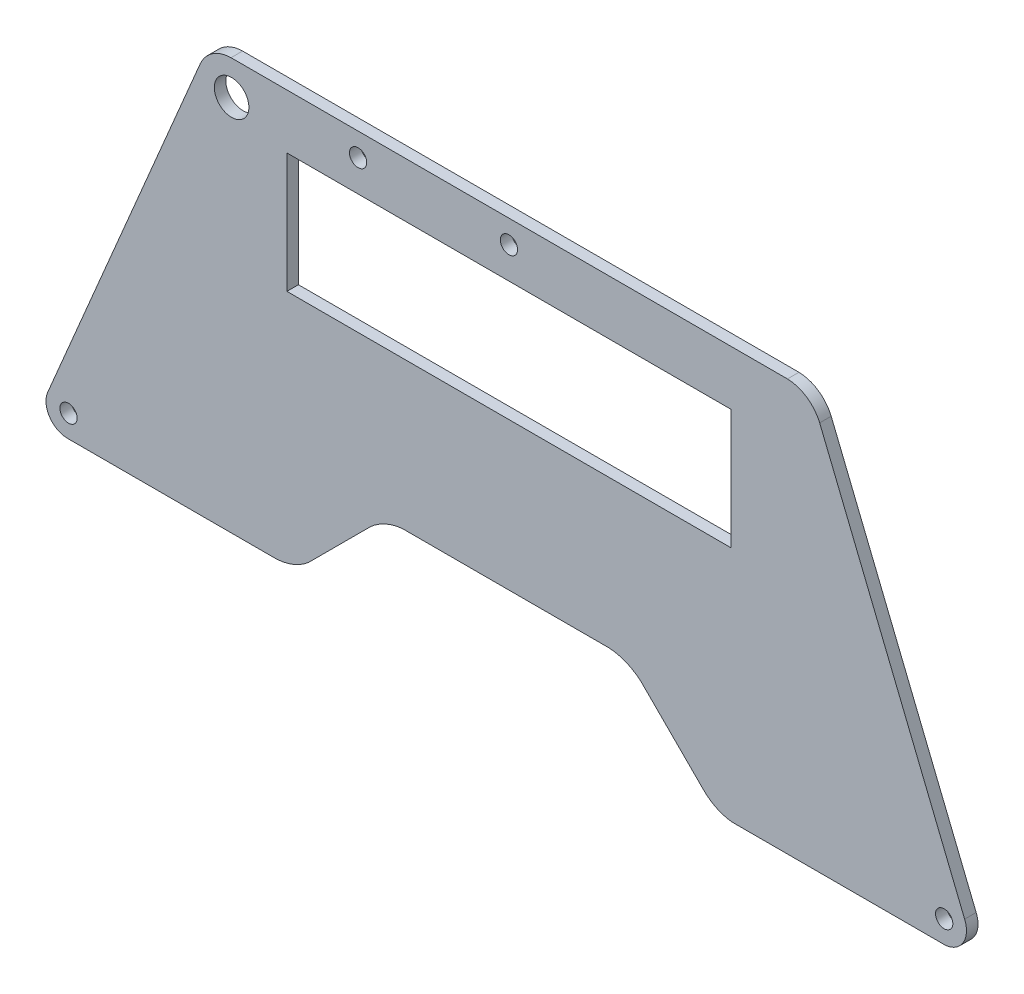
ISO-10303-21;
HEADER;
FILE_DESCRIPTION(('STEP AP214'),'2;1');
FILE_NAME('part.step','',(''),(''),'','','');
FILE_SCHEMA(('AUTOMOTIVE_DESIGN { 1 0 10303 214 1 1 1 1 }'));
ENDSEC;
DATA;
#1=APPLICATION_CONTEXT('core data for automotive mechanical design processes');
#2=APPLICATION_PROTOCOL_DEFINITION('international standard','automotive_design',2000,#1);
#3=PRODUCT_CONTEXT('',#1,'mechanical');
#4=PRODUCT('Part','Part','',(#3));
#5=PRODUCT_RELATED_PRODUCT_CATEGORY('part','',(#4));
#6=PRODUCT_DEFINITION_FORMATION('','',#4);
#7=PRODUCT_DEFINITION_CONTEXT('part definition',#1,'design');
#8=PRODUCT_DEFINITION('design','',#6,#7);
#9=PRODUCT_DEFINITION_SHAPE('','',#8);
#10=(LENGTH_UNIT() NAMED_UNIT(*) SI_UNIT(.MILLI.,.METRE.));
#11=(NAMED_UNIT(*) PLANE_ANGLE_UNIT() SI_UNIT($,.RADIAN.));
#12=(NAMED_UNIT(*) SI_UNIT($,.STERADIAN.) SOLID_ANGLE_UNIT());
#13=UNCERTAINTY_MEASURE_WITH_UNIT(LENGTH_MEASURE(1.E-05),#10,'distance_accuracy_value','');
#14=(GEOMETRIC_REPRESENTATION_CONTEXT(3) GLOBAL_UNCERTAINTY_ASSIGNED_CONTEXT((#13)) GLOBAL_UNIT_ASSIGNED_CONTEXT((#10,
#11,#12)) REPRESENTATION_CONTEXT('',''));
#15=CARTESIAN_POINT('',(0.,0.,0.));
#16=DIRECTION('',(0.,0.,1.));
#17=DIRECTION('',(1.,0.,0.));
#18=AXIS2_PLACEMENT_3D('',#15,#16,#17);
#19=CARTESIAN_POINT('',(-4.151217638522,4.131310422763,2.));
#20=DIRECTION('',(0.,0.,1.));
#21=DIRECTION('',(1.,0.,0.));
#22=AXIS2_PLACEMENT_3D('',#19,#20,#21);
#23=PLANE('',#22);
#24=DIRECTION('',(0.,-1.,0.));
#25=VECTOR('',#24,1.);
#26=CARTESIAN_POINT('',(-41.0120005829996,41.2408212324495,2.));
#27=LINE('',#26,#25);
#28=CARTESIAN_POINT('',(-41.0120005829996,62.0408178666725,2.));
#29=VERTEX_POINT('',#28);
#30=CARTESIAN_POINT('',(-41.0120005829996,41.2408212324495,2.));
#31=VERTEX_POINT('',#30);
#32=EDGE_CURVE('E176',#29,#31,#27,.T.);
#33=ORIENTED_EDGE('',*,*,#32,.T.);
#34=DIRECTION('',(-1.,0.,0.));
#35=VECTOR('',#34,1.);
#36=CARTESIAN_POINT('',(-41.0120005829996,41.2408212324495,2.));
#37=LINE('',#36,#35);
#38=CARTESIAN_POINT('',(-118.012001492196,41.2408212324495,2.));
#39=VERTEX_POINT('',#38);
#40=EDGE_CURVE('E185',#31,#39,#37,.T.);
#41=ORIENTED_EDGE('',*,*,#40,.T.);
#42=DIRECTION('',(0.,1.,0.));
#43=VECTOR('',#42,1.);
#44=CARTESIAN_POINT('',(-118.012001492196,41.2408212324495,2.));
#45=LINE('',#44,#43);
#46=CARTESIAN_POINT('',(-118.012001492196,62.0408178666725,2.));
#47=VERTEX_POINT('',#46);
#48=EDGE_CURVE('E52',#39,#47,#45,.T.);
#49=ORIENTED_EDGE('',*,*,#48,.T.);
#50=DIRECTION('',(1.,0.,0.));
#51=VECTOR('',#50,1.);
#52=CARTESIAN_POINT('',(-41.0120005829996,62.0408178666725,2.));
#53=LINE('',#52,#51);
#54=EDGE_CURVE('E182',#47,#29,#53,.T.);
#55=ORIENTED_EDGE('',*,*,#54,.T.);
#56=EDGE_LOOP('',(#33,#41,#49,#55));
#57=FACE_BOUND('',#56,.T.);
#58=CARTESIAN_POINT('',(-4.,4.,2.));
#59=DIRECTION('',(0.,0.,1.));
#60=DIRECTION('',(1.,0.,0.));
#61=AXIS2_PLACEMENT_3D('',#58,#59,#60);
#62=CIRCLE('',#61,1.5);
#63=CARTESIAN_POINT('',(-2.5,4.,2.));
#64=VERTEX_POINT('',#63);
#65=EDGE_CURVE('E216',#64,#64,#62,.T.);
#66=ORIENTED_EDGE('',*,*,#65,.F.);
#67=EDGE_LOOP('',(#66));
#68=FACE_BOUND('',#67,.T.);
#69=CARTESIAN_POINT('',(-105.664,67.501,2.));
#70=DIRECTION('',(0.,0.,1.));
#71=DIRECTION('',(1.,0.,0.));
#72=AXIS2_PLACEMENT_3D('',#69,#70,#71);
#73=CIRCLE('',#72,1.5);
#74=CARTESIAN_POINT('',(-104.164,67.501,2.));
#75=VERTEX_POINT('',#74);
#76=EDGE_CURVE('E228',#75,#75,#73,.T.);
#77=ORIENTED_EDGE('',*,*,#76,.F.);
#78=EDGE_LOOP('',(#77));
#79=FACE_BOUND('',#78,.T.);
#80=CARTESIAN_POINT('',(-4.151217638522,4.131310422763,2.));
#81=DIRECTION('',(0.,0.,1.));
#82=DIRECTION('',(1.,0.,0.));
#83=AXIS2_PLACEMENT_3D('',#80,#81,#82);
#84=CIRCLE('',#83,4.02396369444375);
#85=CARTESIAN_POINT('',(-3.754,0.127,2.));
#86=VERTEX_POINT('',#85);
#87=CARTESIAN_POINT('',(-0.451999999999999,5.715,2.));
#88=VERTEX_POINT('',#87);
#89=EDGE_CURVE('E240',#86,#88,#84,.T.);
#90=ORIENTED_EDGE('',*,*,#89,.T.);
#91=DIRECTION('',(-0.375969548658757,0.926632018916533,0.));
#92=VECTOR('',#91,1.);
#93=CARTESIAN_POINT('',(-0.451999999999999,5.715,2.));
#94=LINE('',#93,#92);
#95=CARTESIAN_POINT('',(-25.5979999999999,67.691,2.));
#96=VERTEX_POINT('',#95);
#97=EDGE_CURVE('E243',#88,#96,#94,.T.);
#98=ORIENTED_EDGE('',*,*,#97,.T.);
#99=CARTESIAN_POINT('',(-31.340445195421,65.271613713382,2.));
#100=DIRECTION('',(0.,0.,1.));
#101=DIRECTION('',(1.,0.,0.));
#102=AXIS2_PLACEMENT_3D('',#99,#100,#101);
#103=CIRCLE('',#102,6.23130057261644);
#104=CARTESIAN_POINT('',(-31.186,71.5009999999998,2.));
#105=VERTEX_POINT('',#104);
#106=EDGE_CURVE('E246',#96,#105,#103,.T.);
#107=ORIENTED_EDGE('',*,*,#106,.T.);
#108=DIRECTION('',(-1.,0.,0.));
#109=VECTOR('',#108,1.);
#110=CARTESIAN_POINT('',(-31.186,71.5009999999998,2.));
#111=LINE('',#110,#109);
#112=CARTESIAN_POINT('',(-127.706,71.5010000000001,2.));
#113=VERTEX_POINT('',#112);
#114=EDGE_CURVE('E248',#105,#113,#111,.T.);
#115=ORIENTED_EDGE('',*,*,#114,.T.);
#116=CARTESIAN_POINT('',(-127.61079487934,65.579692319011,2.));
#117=DIRECTION('',(0.,0.,1.));
#118=DIRECTION('',(1.,0.,0.));
#119=AXIS2_PLACEMENT_3D('',#116,#117,#118);
#120=CIRCLE('',#119,5.92207300427315);
#121=CARTESIAN_POINT('',(-133.04,67.9449999999999,2.));
#122=VERTEX_POINT('',#121);
#123=EDGE_CURVE('E250',#113,#122,#120,.T.);
#124=ORIENTED_EDGE('',*,*,#123,.T.);
#125=DIRECTION('',(-0.389395688742522,-0.921070571448647,0.));
#126=VECTOR('',#125,1.);
#127=CARTESIAN_POINT('',(-133.04,67.9449999999999,2.));
#128=LINE('',#127,#126);
#129=CARTESIAN_POINT('',(-159.456,5.46099999999984,2.));
#130=VERTEX_POINT('',#129);
#131=EDGE_CURVE('E252',#122,#130,#128,.T.);
#132=ORIENTED_EDGE('',*,*,#131,.T.);
#133=CARTESIAN_POINT('',(-156.06418230582,3.871649048777,2.));
#134=DIRECTION('',(0.,0.,1.));
#135=DIRECTION('',(1.,0.,0.));
#136=AXIS2_PLACEMENT_3D('',#133,#134,#135);
#137=CIRCLE('',#136,3.74572606001867);
#138=CARTESIAN_POINT('',(-156.154,0.126999999999228,2.));
#139=VERTEX_POINT('',#138);
#140=EDGE_CURVE('E254',#130,#139,#137,.T.);
#141=ORIENTED_EDGE('',*,*,#140,.T.);
#142=DIRECTION('',(1.,0.,0.));
#143=VECTOR('',#142,1.);
#144=CARTESIAN_POINT('',(-156.154,0.126999999999228,2.));
#145=LINE('',#144,#143);
#146=CARTESIAN_POINT('',(-119.832,0.127000000001192,2.));
#147=VERTEX_POINT('',#146);
#148=EDGE_CURVE('E256',#139,#147,#145,.T.);
#149=ORIENTED_EDGE('',*,*,#148,.T.);
#150=CARTESIAN_POINT('',(-120.33100582692,9.319569799157,2.));
#151=DIRECTION('',(0.,0.,1.));
#152=DIRECTION('',(1.,0.,0.));
#153=AXIS2_PLACEMENT_3D('',#150,#151,#152);
#154=CIRCLE('',#153,9.20610375390434);
#155=CARTESIAN_POINT('',(-114.243999999998,2.41299999999821,2.));
#156=VERTEX_POINT('',#155);
#157=EDGE_CURVE('E258',#147,#156,#154,.T.);
#158=ORIENTED_EDGE('',*,*,#157,.T.);
#159=DIRECTION('',(0.707106781186436,0.707106781186659,0.));
#160=VECTOR('',#159,1.);
#161=CARTESIAN_POINT('',(-114.243999999998,2.41299999999821,2.));
#162=LINE('',#161,#160);
#163=CARTESIAN_POINT('',(-103.576,13.0810000000001,2.));
#164=VERTEX_POINT('',#163);
#165=EDGE_CURVE('E260',#156,#164,#162,.T.);
#166=ORIENTED_EDGE('',*,*,#165,.T.);
#167=CARTESIAN_POINT('',(-97.057030091087,6.15606620039,2.));
#168=DIRECTION('',(0.,0.,-1.));
#169=DIRECTION('',(1.,0.,0.));
#170=AXIS2_PLACEMENT_3D('',#167,#168,#169);
#171=CIRCLE('',#170,9.51060864520752);
#172=CARTESIAN_POINT('',(-97.988,15.6209999999998,2.));
#173=VERTEX_POINT('',#172);
#174=EDGE_CURVE('E262',#164,#173,#171,.T.);
#175=ORIENTED_EDGE('',*,*,#174,.T.);
#176=DIRECTION('',(1.,0.,0.));
#177=VECTOR('',#176,1.);
#178=CARTESIAN_POINT('',(-97.988,15.6209999999998,2.));
#179=LINE('',#178,#177);
#180=CARTESIAN_POINT('',(-62.174,15.621,2.));
#181=VERTEX_POINT('',#180);
#182=EDGE_CURVE('E264',#173,#181,#179,.T.);
#183=ORIENTED_EDGE('',*,*,#182,.T.);
#184=CARTESIAN_POINT('',(-62.673005826928,6.428430200843,2.));
#185=DIRECTION('',(0.,0.,-1.));
#186=DIRECTION('',(1.,0.,0.));
#187=AXIS2_PLACEMENT_3D('',#184,#185,#186);
#188=CIRCLE('',#187,9.20610375390599);
#189=CARTESIAN_POINT('',(-56.586,13.335,2.));
#190=VERTEX_POINT('',#189);
#191=EDGE_CURVE('E266',#181,#190,#188,.T.);
#192=ORIENTED_EDGE('',*,*,#191,.T.);
#193=DIRECTION('',(0.707106781186549,-0.707106781186546,0.));
#194=VECTOR('',#193,1.);
#195=CARTESIAN_POINT('',(-56.586,13.335,2.));
#196=LINE('',#195,#194);
#197=CARTESIAN_POINT('',(-45.918,2.667,2.));
#198=VERTEX_POINT('',#197);
#199=EDGE_CURVE('E268',#190,#198,#196,.T.);
#200=ORIENTED_EDGE('',*,*,#199,.T.);
#201=CARTESIAN_POINT('',(-39.948522407733,8.255955184534,2.));
#202=DIRECTION('',(0.,0.,1.));
#203=DIRECTION('',(1.,0.,0.));
#204=AXIS2_PLACEMENT_3D('',#201,#202,#203);
#205=CIRCLE('',#204,8.177474107529);
#206=CARTESIAN_POINT('',(-40.838,0.127000000000002,2.));
#207=VERTEX_POINT('',#206);
#208=EDGE_CURVE('E270',#198,#207,#205,.T.);
#209=ORIENTED_EDGE('',*,*,#208,.T.);
#210=DIRECTION('',(1.,0.,0.));
#211=VECTOR('',#210,1.);
#212=CARTESIAN_POINT('',(-40.838,0.127000000000002,2.));
#213=LINE('',#212,#211);
#214=EDGE_CURVE('E272',#207,#86,#213,.T.);
#215=ORIENTED_EDGE('',*,*,#214,.T.);
#216=EDGE_LOOP('',(#90,#98,#107,#115,#124,#132,#141,#149,#158,#166,#175,#183,#192,#200,#209,#215));
#217=FACE_BOUND('',#216,.T.);
#218=CARTESIAN_POINT('',(-127.61079487934,65.579692319011,2.));
#219=DIRECTION('',(0.,0.,1.));
#220=DIRECTION('',(1.,0.,0.));
#221=AXIS2_PLACEMENT_3D('',#218,#219,#220);
#222=CIRCLE('',#221,2.99894589432305);
#223=CARTESIAN_POINT('',(-124.611848985017,65.579692319011,2.));
#224=VERTEX_POINT('',#223);
#225=EDGE_CURVE('E234',#224,#224,#222,.T.);
#226=ORIENTED_EDGE('',*,*,#225,.F.);
#227=EDGE_LOOP('',(#226));
#228=FACE_BOUND('',#227,.T.);
#229=CARTESIAN_POINT('',(-79.5,67.501,2.));
#230=DIRECTION('',(0.,0.,1.));
#231=DIRECTION('',(1.,0.,0.));
#232=AXIS2_PLACEMENT_3D('',#229,#230,#231);
#233=CIRCLE('',#232,1.50000000000001);
#234=CARTESIAN_POINT('',(-78.,67.501,2.));
#235=VERTEX_POINT('',#234);
#236=EDGE_CURVE('E222',#235,#235,#233,.T.);
#237=ORIENTED_EDGE('',*,*,#236,.F.);
#238=EDGE_LOOP('',(#237));
#239=FACE_BOUND('',#238,.T.);
#240=CARTESIAN_POINT('',(-155.893,4.,2.));
#241=DIRECTION('',(0.,0.,1.));
#242=DIRECTION('',(1.,0.,0.));
#243=AXIS2_PLACEMENT_3D('',#240,#241,#242);
#244=CIRCLE('',#243,1.5);
#245=CARTESIAN_POINT('',(-154.393,4.,2.));
#246=VERTEX_POINT('',#245);
#247=EDGE_CURVE('E210',#246,#246,#244,.T.);
#248=ORIENTED_EDGE('',*,*,#247,.F.);
#249=EDGE_LOOP('',(#248));
#250=FACE_BOUND('',#249,.T.);
#251=ADVANCED_FACE('F37',(#57,#68,#79,#217,#228,#239,#250),#23,.T.);
#252=CARTESIAN_POINT('',(-4.151217638522,4.131310422763,0.));
#253=DIRECTION('',(0.,0.,1.));
#254=DIRECTION('',(1.,0.,0.));
#255=AXIS2_PLACEMENT_3D('',#252,#253,#254);
#256=PLANE('',#255);
#257=DIRECTION('',(-1.,0.,0.));
#258=VECTOR('',#257,1.);
#259=CARTESIAN_POINT('',(-41.0120005829996,41.2408212324495,0.));
#260=LINE('',#259,#258);
#261=CARTESIAN_POINT('',(-41.0120005829996,41.2408212324495,0.));
#262=VERTEX_POINT('',#261);
#263=CARTESIAN_POINT('',(-118.012001492196,41.2408212324495,0.));
#264=VERTEX_POINT('',#263);
#265=EDGE_CURVE('E200',#262,#264,#260,.T.);
#266=ORIENTED_EDGE('',*,*,#265,.F.);
#267=DIRECTION('',(0.,-1.,0.));
#268=VECTOR('',#267,1.);
#269=CARTESIAN_POINT('',(-41.0120005829996,41.2408212324495,0.));
#270=LINE('',#269,#268);
#271=CARTESIAN_POINT('',(-41.0120005829996,62.0408178666725,0.));
#272=VERTEX_POINT('',#271);
#273=EDGE_CURVE('E60',#272,#262,#270,.T.);
#274=ORIENTED_EDGE('',*,*,#273,.F.);
#275=DIRECTION('',(1.,0.,0.));
#276=VECTOR('',#275,1.);
#277=CARTESIAN_POINT('',(-41.0120005829996,62.0408178666725,0.));
#278=LINE('',#277,#276);
#279=CARTESIAN_POINT('',(-118.012001492196,62.0408178666725,0.));
#280=VERTEX_POINT('',#279);
#281=EDGE_CURVE('E191',#280,#272,#278,.T.);
#282=ORIENTED_EDGE('',*,*,#281,.F.);
#283=DIRECTION('',(0.,1.,0.));
#284=VECTOR('',#283,1.);
#285=CARTESIAN_POINT('',(-118.012001492196,41.2408212324495,0.));
#286=LINE('',#285,#284);
#287=EDGE_CURVE('E194',#264,#280,#286,.T.);
#288=ORIENTED_EDGE('',*,*,#287,.F.);
#289=EDGE_LOOP('',(#266,#274,#282,#288));
#290=FACE_BOUND('',#289,.T.);
#291=CARTESIAN_POINT('',(-4.151217638522,4.131310422763,0.));
#292=DIRECTION('',(0.,0.,1.));
#293=DIRECTION('',(1.,0.,0.));
#294=AXIS2_PLACEMENT_3D('',#291,#292,#293);
#295=CIRCLE('',#294,4.02396369444375);
#296=CARTESIAN_POINT('',(-3.754,0.127,0.));
#297=VERTEX_POINT('',#296);
#298=CARTESIAN_POINT('',(-0.451999999999999,5.715,0.));
#299=VERTEX_POINT('',#298);
#300=EDGE_CURVE('E237',#297,#299,#295,.T.);
#301=ORIENTED_EDGE('',*,*,#300,.F.);
#302=DIRECTION('',(1.,0.,0.));
#303=VECTOR('',#302,1.);
#304=CARTESIAN_POINT('',(-40.838,0.127000000000002,0.));
#305=LINE('',#304,#303);
#306=CARTESIAN_POINT('',(-40.838,0.127000000000002,0.));
#307=VERTEX_POINT('',#306);
#308=EDGE_CURVE('E244',#307,#297,#305,.T.);
#309=ORIENTED_EDGE('',*,*,#308,.F.);
#310=CARTESIAN_POINT('',(-39.948522407733,8.255955184534,0.));
#311=DIRECTION('',(0.,0.,1.));
#312=DIRECTION('',(1.,0.,0.));
#313=AXIS2_PLACEMENT_3D('',#310,#311,#312);
#314=CIRCLE('',#313,8.177474107529);
#315=CARTESIAN_POINT('',(-45.918,2.667,0.));
#316=VERTEX_POINT('',#315);
#317=EDGE_CURVE('E303',#316,#307,#314,.T.);
#318=ORIENTED_EDGE('',*,*,#317,.F.);
#319=DIRECTION('',(0.707106781186549,-0.707106781186546,0.));
#320=VECTOR('',#319,1.);
#321=CARTESIAN_POINT('',(-56.586,13.335,0.));
#322=LINE('',#321,#320);
#323=CARTESIAN_POINT('',(-56.586,13.335,0.));
#324=VERTEX_POINT('',#323);
#325=EDGE_CURVE('E301',#324,#316,#322,.T.);
#326=ORIENTED_EDGE('',*,*,#325,.F.);
#327=CARTESIAN_POINT('',(-62.673005826928,6.428430200843,0.));
#328=DIRECTION('',(0.,0.,-1.));
#329=DIRECTION('',(1.,0.,0.));
#330=AXIS2_PLACEMENT_3D('',#327,#328,#329);
#331=CIRCLE('',#330,9.20610375390599);
#332=CARTESIAN_POINT('',(-62.174,15.621,0.));
#333=VERTEX_POINT('',#332);
#334=EDGE_CURVE('E299',#333,#324,#331,.T.);
#335=ORIENTED_EDGE('',*,*,#334,.F.);
#336=DIRECTION('',(1.,0.,0.));
#337=VECTOR('',#336,1.);
#338=CARTESIAN_POINT('',(-97.988,15.6209999999998,0.));
#339=LINE('',#338,#337);
#340=CARTESIAN_POINT('',(-97.988,15.6209999999998,0.));
#341=VERTEX_POINT('',#340);
#342=EDGE_CURVE('E297',#341,#333,#339,.T.);
#343=ORIENTED_EDGE('',*,*,#342,.F.);
#344=CARTESIAN_POINT('',(-97.057030091087,6.15606620039,0.));
#345=DIRECTION('',(0.,0.,-1.));
#346=DIRECTION('',(1.,0.,0.));
#347=AXIS2_PLACEMENT_3D('',#344,#345,#346);
#348=CIRCLE('',#347,9.51060864520752);
#349=CARTESIAN_POINT('',(-103.576,13.0810000000001,0.));
#350=VERTEX_POINT('',#349);
#351=EDGE_CURVE('E295',#350,#341,#348,.T.);
#352=ORIENTED_EDGE('',*,*,#351,.F.);
#353=DIRECTION('',(0.707106781186436,0.707106781186659,0.));
#354=VECTOR('',#353,1.);
#355=CARTESIAN_POINT('',(-114.243999999998,2.41299999999821,0.));
#356=LINE('',#355,#354);
#357=CARTESIAN_POINT('',(-114.243999999998,2.41299999999821,0.));
#358=VERTEX_POINT('',#357);
#359=EDGE_CURVE('E293',#358,#350,#356,.T.);
#360=ORIENTED_EDGE('',*,*,#359,.F.);
#361=CARTESIAN_POINT('',(-120.33100582692,9.319569799157,0.));
#362=DIRECTION('',(0.,0.,1.));
#363=DIRECTION('',(1.,0.,0.));
#364=AXIS2_PLACEMENT_3D('',#361,#362,#363);
#365=CIRCLE('',#364,9.20610375390434);
#366=CARTESIAN_POINT('',(-119.832,0.127000000001192,0.));
#367=VERTEX_POINT('',#366);
#368=EDGE_CURVE('E291',#367,#358,#365,.T.);
#369=ORIENTED_EDGE('',*,*,#368,.F.);
#370=DIRECTION('',(1.,0.,0.));
#371=VECTOR('',#370,1.);
#372=CARTESIAN_POINT('',(-156.154,0.126999999999228,0.));
#373=LINE('',#372,#371);
#374=CARTESIAN_POINT('',(-156.154,0.126999999999228,0.));
#375=VERTEX_POINT('',#374);
#376=EDGE_CURVE('E289',#375,#367,#373,.T.);
#377=ORIENTED_EDGE('',*,*,#376,.F.);
#378=CARTESIAN_POINT('',(-156.06418230582,3.871649048777,0.));
#379=DIRECTION('',(0.,0.,1.));
#380=DIRECTION('',(1.,0.,0.));
#381=AXIS2_PLACEMENT_3D('',#378,#379,#380);
#382=CIRCLE('',#381,3.74572606001867);
#383=CARTESIAN_POINT('',(-159.456,5.46099999999984,0.));
#384=VERTEX_POINT('',#383);
#385=EDGE_CURVE('E287',#384,#375,#382,.T.);
#386=ORIENTED_EDGE('',*,*,#385,.F.);
#387=DIRECTION('',(-0.389395688742522,-0.921070571448647,0.));
#388=VECTOR('',#387,1.);
#389=CARTESIAN_POINT('',(-133.04,67.9449999999999,0.));
#390=LINE('',#389,#388);
#391=CARTESIAN_POINT('',(-133.04,67.9449999999999,0.));
#392=VERTEX_POINT('',#391);
#393=EDGE_CURVE('E285',#392,#384,#390,.T.);
#394=ORIENTED_EDGE('',*,*,#393,.F.);
#395=CARTESIAN_POINT('',(-127.61079487934,65.579692319011,0.));
#396=DIRECTION('',(0.,0.,1.));
#397=DIRECTION('',(1.,0.,0.));
#398=AXIS2_PLACEMENT_3D('',#395,#396,#397);
#399=CIRCLE('',#398,5.92207300427315);
#400=CARTESIAN_POINT('',(-127.706,71.5010000000001,0.));
#401=VERTEX_POINT('',#400);
#402=EDGE_CURVE('E283',#401,#392,#399,.T.);
#403=ORIENTED_EDGE('',*,*,#402,.F.);
#404=DIRECTION('',(-1.,0.,0.));
#405=VECTOR('',#404,1.);
#406=CARTESIAN_POINT('',(-31.186,71.5009999999998,0.));
#407=LINE('',#406,#405);
#408=CARTESIAN_POINT('',(-31.186,71.5009999999998,0.));
#409=VERTEX_POINT('',#408);
#410=EDGE_CURVE('E281',#409,#401,#407,.T.);
#411=ORIENTED_EDGE('',*,*,#410,.F.);
#412=CARTESIAN_POINT('',(-31.340445195421,65.271613713382,0.));
#413=DIRECTION('',(0.,0.,1.));
#414=DIRECTION('',(1.,0.,0.));
#415=AXIS2_PLACEMENT_3D('',#412,#413,#414);
#416=CIRCLE('',#415,6.23130057261644);
#417=CARTESIAN_POINT('',(-25.5979999999999,67.691,0.));
#418=VERTEX_POINT('',#417);
#419=EDGE_CURVE('E279',#418,#409,#416,.T.);
#420=ORIENTED_EDGE('',*,*,#419,.F.);
#421=DIRECTION('',(-0.375969548658757,0.926632018916533,0.));
#422=VECTOR('',#421,1.);
#423=CARTESIAN_POINT('',(-0.451999999999999,5.715,0.));
#424=LINE('',#423,#422);
#425=EDGE_CURVE('E277',#299,#418,#424,.T.);
#426=ORIENTED_EDGE('',*,*,#425,.F.);
#427=EDGE_LOOP('',(#301,#309,#318,#326,#335,#343,#352,#360,#369,#377,#386,#394,#403,#411,#420,#426));
#428=FACE_BOUND('',#427,.T.);
#429=CARTESIAN_POINT('',(-127.61079487934,65.579692319011,0.));
#430=DIRECTION('',(0.,0.,1.));
#431=DIRECTION('',(1.,0.,0.));
#432=AXIS2_PLACEMENT_3D('',#429,#430,#431);
#433=CIRCLE('',#432,2.99894589432305);
#434=CARTESIAN_POINT('',(-124.611848985017,65.579692319011,0.));
#435=VERTEX_POINT('',#434);
#436=EDGE_CURVE('E231',#435,#435,#433,.T.);
#437=ORIENTED_EDGE('',*,*,#436,.T.);
#438=EDGE_LOOP('',(#437));
#439=FACE_BOUND('',#438,.T.);
#440=CARTESIAN_POINT('',(-105.664,67.501,0.));
#441=DIRECTION('',(0.,0.,1.));
#442=DIRECTION('',(1.,0.,0.));
#443=AXIS2_PLACEMENT_3D('',#440,#441,#442);
#444=CIRCLE('',#443,1.5);
#445=CARTESIAN_POINT('',(-104.164,67.501,0.));
#446=VERTEX_POINT('',#445);
#447=EDGE_CURVE('E225',#446,#446,#444,.T.);
#448=ORIENTED_EDGE('',*,*,#447,.T.);
#449=EDGE_LOOP('',(#448));
#450=FACE_BOUND('',#449,.T.);
#451=CARTESIAN_POINT('',(-79.5,67.501,0.));
#452=DIRECTION('',(0.,0.,1.));
#453=DIRECTION('',(1.,0.,0.));
#454=AXIS2_PLACEMENT_3D('',#451,#452,#453);
#455=CIRCLE('',#454,1.50000000000001);
#456=CARTESIAN_POINT('',(-78.,67.501,0.));
#457=VERTEX_POINT('',#456);
#458=EDGE_CURVE('E219',#457,#457,#455,.T.);
#459=ORIENTED_EDGE('',*,*,#458,.T.);
#460=EDGE_LOOP('',(#459));
#461=FACE_BOUND('',#460,.T.);
#462=CARTESIAN_POINT('',(-4.,4.,0.));
#463=DIRECTION('',(0.,0.,1.));
#464=DIRECTION('',(1.,0.,0.));
#465=AXIS2_PLACEMENT_3D('',#462,#463,#464);
#466=CIRCLE('',#465,1.5);
#467=CARTESIAN_POINT('',(-2.5,4.,0.));
#468=VERTEX_POINT('',#467);
#469=EDGE_CURVE('E213',#468,#468,#466,.T.);
#470=ORIENTED_EDGE('',*,*,#469,.T.);
#471=EDGE_LOOP('',(#470));
#472=FACE_BOUND('',#471,.T.);
#473=CARTESIAN_POINT('',(-155.893,4.,0.));
#474=DIRECTION('',(0.,0.,1.));
#475=DIRECTION('',(1.,0.,0.));
#476=AXIS2_PLACEMENT_3D('',#473,#474,#475);
#477=CIRCLE('',#476,1.5);
#478=CARTESIAN_POINT('',(-154.393,4.,0.));
#479=VERTEX_POINT('',#478);
#480=EDGE_CURVE('E206',#479,#479,#477,.T.);
#481=ORIENTED_EDGE('',*,*,#480,.T.);
#482=EDGE_LOOP('',(#481));
#483=FACE_BOUND('',#482,.T.);
#484=ADVANCED_FACE('F357',(#290,#428,#439,#450,#461,#472,#483),#256,.F.);
#485=CARTESIAN_POINT('',(-4.151217638522,4.131310422763,2.));
#486=DIRECTION('',(0.,0.,-1.));
#487=DIRECTION('',(-1.,0.,0.));
#488=AXIS2_PLACEMENT_3D('',#485,#486,#487);
#489=CYLINDRICAL_SURFACE('',#488,4.02396369444375);
#490=ORIENTED_EDGE('',*,*,#300,.T.);
#491=DIRECTION('',(0.,0.,-1.));
#492=VECTOR('',#491,1.);
#493=CARTESIAN_POINT('',(-0.451999999999999,5.715,2.));
#494=LINE('',#493,#492);
#495=EDGE_CURVE('E11',#88,#299,#494,.T.);
#496=ORIENTED_EDGE('',*,*,#495,.F.);
#497=ORIENTED_EDGE('',*,*,#89,.F.);
#498=DIRECTION('',(0.,0.,-1.));
#499=VECTOR('',#498,1.);
#500=CARTESIAN_POINT('',(-3.754,0.127,2.));
#501=LINE('',#500,#499);
#502=EDGE_CURVE('E274',#86,#297,#501,.T.);
#503=ORIENTED_EDGE('',*,*,#502,.T.);
#504=EDGE_LOOP('',(#490,#496,#497,#503));
#505=FACE_BOUND('',#504,.T.);
#506=ADVANCED_FACE('F39',(#505),#489,.T.);
#507=CARTESIAN_POINT('',(-0.451999999999999,5.715,2.));
#508=DIRECTION('',(-0.926632018916533,-0.375969548658757,0.));
#509=DIRECTION('',(0.375969548658757,-0.926632018916533,0.));
#510=AXIS2_PLACEMENT_3D('',#507,#508,#509);
#511=PLANE('',#510);
#512=ORIENTED_EDGE('',*,*,#425,.T.);
#513=DIRECTION('',(0.,0.,-1.));
#514=VECTOR('',#513,1.);
#515=CARTESIAN_POINT('',(-25.5979999999999,67.691,2.));
#516=LINE('',#515,#514);
#517=EDGE_CURVE('E45',#96,#418,#516,.T.);
#518=ORIENTED_EDGE('',*,*,#517,.F.);
#519=ORIENTED_EDGE('',*,*,#97,.F.);
#520=ORIENTED_EDGE('',*,*,#495,.T.);
#521=EDGE_LOOP('',(#512,#518,#519,#520));
#522=FACE_BOUND('',#521,.T.);
#523=ADVANCED_FACE('F375',(#522),#511,.F.);
#524=CARTESIAN_POINT('',(-31.340445195421,65.271613713382,2.));
#525=DIRECTION('',(0.,0.,-1.));
#526=DIRECTION('',(-1.,0.,0.));
#527=AXIS2_PLACEMENT_3D('',#524,#525,#526);
#528=CYLINDRICAL_SURFACE('',#527,6.23130057261644);
#529=ORIENTED_EDGE('',*,*,#419,.T.);
#530=DIRECTION('',(0.,0.,-1.));
#531=VECTOR('',#530,1.);
#532=CARTESIAN_POINT('',(-31.186,71.5009999999998,2.));
#533=LINE('',#532,#531);
#534=EDGE_CURVE('E344',#105,#409,#533,.T.);
#535=ORIENTED_EDGE('',*,*,#534,.F.);
#536=ORIENTED_EDGE('',*,*,#106,.F.);
#537=ORIENTED_EDGE('',*,*,#517,.T.);
#538=EDGE_LOOP('',(#529,#535,#536,#537));
#539=FACE_BOUND('',#538,.T.);
#540=ADVANCED_FACE('F351',(#539),#528,.T.);
#541=CARTESIAN_POINT('',(-31.186,71.5009999999998,2.));
#542=DIRECTION('',(0.,-1.,0.));
#543=DIRECTION('',(1.,0.,0.));
#544=AXIS2_PLACEMENT_3D('',#541,#542,#543);
#545=PLANE('',#544);
#546=ORIENTED_EDGE('',*,*,#410,.T.);
#547=DIRECTION('',(0.,0.,-1.));
#548=VECTOR('',#547,1.);
#549=CARTESIAN_POINT('',(-127.706,71.5010000000001,2.));
#550=LINE('',#549,#548);
#551=EDGE_CURVE('E341',#113,#401,#550,.T.);
#552=ORIENTED_EDGE('',*,*,#551,.F.);
#553=ORIENTED_EDGE('',*,*,#114,.F.);
#554=ORIENTED_EDGE('',*,*,#534,.T.);
#555=EDGE_LOOP('',(#546,#552,#553,#554));
#556=FACE_BOUND('',#555,.T.);
#557=ADVANCED_FACE('F363',(#556),#545,.F.);
#558=CARTESIAN_POINT('',(-127.61079487934,65.579692319011,2.));
#559=DIRECTION('',(0.,0.,-1.));
#560=DIRECTION('',(-1.,0.,0.));
#561=AXIS2_PLACEMENT_3D('',#558,#559,#560);
#562=CYLINDRICAL_SURFACE('',#561,5.92207300427315);
#563=ORIENTED_EDGE('',*,*,#402,.T.);
#564=DIRECTION('',(0.,0.,-1.));
#565=VECTOR('',#564,1.);
#566=CARTESIAN_POINT('',(-133.04,67.9449999999999,2.));
#567=LINE('',#566,#565);
#568=EDGE_CURVE('E338',#122,#392,#567,.T.);
#569=ORIENTED_EDGE('',*,*,#568,.F.);
#570=ORIENTED_EDGE('',*,*,#123,.F.);
#571=ORIENTED_EDGE('',*,*,#551,.T.);
#572=EDGE_LOOP('',(#563,#569,#570,#571));
#573=FACE_BOUND('',#572,.T.);
#574=ADVANCED_FACE('F367',(#573),#562,.T.);
#575=CARTESIAN_POINT('',(-133.04,67.9449999999999,2.));
#576=DIRECTION('',(0.921070571448647,-0.389395688742522,0.));
#577=DIRECTION('',(0.389395688742522,0.921070571448647,0.));
#578=AXIS2_PLACEMENT_3D('',#575,#576,#577);
#579=PLANE('',#578);
#580=ORIENTED_EDGE('',*,*,#393,.T.);
#581=DIRECTION('',(0.,0.,-1.));
#582=VECTOR('',#581,1.);
#583=CARTESIAN_POINT('',(-159.456,5.46099999999984,2.));
#584=LINE('',#583,#582);
#585=EDGE_CURVE('E335',#130,#384,#584,.T.);
#586=ORIENTED_EDGE('',*,*,#585,.F.);
#587=ORIENTED_EDGE('',*,*,#131,.F.);
#588=ORIENTED_EDGE('',*,*,#568,.T.);
#589=EDGE_LOOP('',(#580,#586,#587,#588));
#590=FACE_BOUND('',#589,.T.);
#591=ADVANCED_FACE('F428',(#590),#579,.F.);
#592=CARTESIAN_POINT('',(-156.06418230582,3.871649048777,2.));
#593=DIRECTION('',(0.,0.,-1.));
#594=DIRECTION('',(-1.,0.,0.));
#595=AXIS2_PLACEMENT_3D('',#592,#593,#594);
#596=CYLINDRICAL_SURFACE('',#595,3.74572606001867);
#597=ORIENTED_EDGE('',*,*,#385,.T.);
#598=DIRECTION('',(0.,0.,-1.));
#599=VECTOR('',#598,1.);
#600=CARTESIAN_POINT('',(-156.154,0.126999999999228,2.));
#601=LINE('',#600,#599);
#602=EDGE_CURVE('E332',#139,#375,#601,.T.);
#603=ORIENTED_EDGE('',*,*,#602,.F.);
#604=ORIENTED_EDGE('',*,*,#140,.F.);
#605=ORIENTED_EDGE('',*,*,#585,.T.);
#606=EDGE_LOOP('',(#597,#603,#604,#605));
#607=FACE_BOUND('',#606,.T.);
#608=ADVANCED_FACE('F425',(#607),#596,.T.);
#609=CARTESIAN_POINT('',(-156.154,0.126999999999228,2.));
#610=DIRECTION('',(0.,1.,0.));
#611=DIRECTION('',(-1.,0.,0.));
#612=AXIS2_PLACEMENT_3D('',#609,#610,#611);
#613=PLANE('',#612);
#614=ORIENTED_EDGE('',*,*,#376,.T.);
#615=DIRECTION('',(0.,0.,-1.));
#616=VECTOR('',#615,1.);
#617=CARTESIAN_POINT('',(-119.832,0.127000000001192,2.));
#618=LINE('',#617,#616);
#619=EDGE_CURVE('E329',#147,#367,#618,.T.);
#620=ORIENTED_EDGE('',*,*,#619,.F.);
#621=ORIENTED_EDGE('',*,*,#148,.F.);
#622=ORIENTED_EDGE('',*,*,#602,.T.);
#623=EDGE_LOOP('',(#614,#620,#621,#622));
#624=FACE_BOUND('',#623,.T.);
#625=ADVANCED_FACE('F421',(#624),#613,.F.);
#626=CARTESIAN_POINT('',(-120.33100582692,9.319569799157,2.));
#627=DIRECTION('',(0.,0.,-1.));
#628=DIRECTION('',(-1.,0.,0.));
#629=AXIS2_PLACEMENT_3D('',#626,#627,#628);
#630=CYLINDRICAL_SURFACE('',#629,9.20610375390434);
#631=ORIENTED_EDGE('',*,*,#368,.T.);
#632=DIRECTION('',(0.,0.,-1.));
#633=VECTOR('',#632,1.);
#634=CARTESIAN_POINT('',(-114.243999999998,2.41299999999821,2.));
#635=LINE('',#634,#633);
#636=EDGE_CURVE('E326',#156,#358,#635,.T.);
#637=ORIENTED_EDGE('',*,*,#636,.F.);
#638=ORIENTED_EDGE('',*,*,#157,.F.);
#639=ORIENTED_EDGE('',*,*,#619,.T.);
#640=EDGE_LOOP('',(#631,#637,#638,#639));
#641=FACE_BOUND('',#640,.T.);
#642=ADVANCED_FACE('F417',(#641),#630,.T.);
#643=CARTESIAN_POINT('',(-114.243999999998,2.41299999999821,2.));
#644=DIRECTION('',(-0.707106781186659,0.707106781186436,0.));
#645=DIRECTION('',(-0.707106781186436,-0.707106781186659,0.));
#646=AXIS2_PLACEMENT_3D('',#643,#644,#645);
#647=PLANE('',#646);
#648=ORIENTED_EDGE('',*,*,#359,.T.);
#649=DIRECTION('',(0.,0.,-1.));
#650=VECTOR('',#649,1.);
#651=CARTESIAN_POINT('',(-103.576,13.0810000000001,2.));
#652=LINE('',#651,#650);
#653=EDGE_CURVE('E323',#164,#350,#652,.T.);
#654=ORIENTED_EDGE('',*,*,#653,.F.);
#655=ORIENTED_EDGE('',*,*,#165,.F.);
#656=ORIENTED_EDGE('',*,*,#636,.T.);
#657=EDGE_LOOP('',(#648,#654,#655,#656));
#658=FACE_BOUND('',#657,.T.);
#659=ADVANCED_FACE('F412',(#658),#647,.F.);
#660=CARTESIAN_POINT('',(-97.057030091087,6.15606620039,2.));
#661=DIRECTION('',(0.,0.,-1.));
#662=DIRECTION('',(-1.,0.,0.));
#663=AXIS2_PLACEMENT_3D('',#660,#661,#662);
#664=CYLINDRICAL_SURFACE('',#663,9.51060864520752);
#665=ORIENTED_EDGE('',*,*,#351,.T.);
#666=DIRECTION('',(0.,0.,-1.));
#667=VECTOR('',#666,1.);
#668=CARTESIAN_POINT('',(-97.988,15.6209999999998,2.));
#669=LINE('',#668,#667);
#670=EDGE_CURVE('E320',#173,#341,#669,.T.);
#671=ORIENTED_EDGE('',*,*,#670,.F.);
#672=ORIENTED_EDGE('',*,*,#174,.F.);
#673=ORIENTED_EDGE('',*,*,#653,.T.);
#674=EDGE_LOOP('',(#665,#671,#672,#673));
#675=FACE_BOUND('',#674,.T.);
#676=ADVANCED_FACE('F406',(#675),#664,.F.);
#677=CARTESIAN_POINT('',(-97.988,15.6209999999998,2.));
#678=DIRECTION('',(0.,1.,0.));
#679=DIRECTION('',(-1.,0.,0.));
#680=AXIS2_PLACEMENT_3D('',#677,#678,#679);
#681=PLANE('',#680);
#682=ORIENTED_EDGE('',*,*,#342,.T.);
#683=DIRECTION('',(0.,0.,-1.));
#684=VECTOR('',#683,1.);
#685=CARTESIAN_POINT('',(-62.174,15.621,2.));
#686=LINE('',#685,#684);
#687=EDGE_CURVE('E317',#181,#333,#686,.T.);
#688=ORIENTED_EDGE('',*,*,#687,.F.);
#689=ORIENTED_EDGE('',*,*,#182,.F.);
#690=ORIENTED_EDGE('',*,*,#670,.T.);
#691=EDGE_LOOP('',(#682,#688,#689,#690));
#692=FACE_BOUND('',#691,.T.);
#693=ADVANCED_FACE('F402',(#692),#681,.F.);
#694=CARTESIAN_POINT('',(-62.673005826928,6.428430200843,2.));
#695=DIRECTION('',(0.,0.,-1.));
#696=DIRECTION('',(-1.,0.,0.));
#697=AXIS2_PLACEMENT_3D('',#694,#695,#696);
#698=CYLINDRICAL_SURFACE('',#697,9.20610375390599);
#699=ORIENTED_EDGE('',*,*,#334,.T.);
#700=DIRECTION('',(0.,0.,-1.));
#701=VECTOR('',#700,1.);
#702=CARTESIAN_POINT('',(-56.586,13.335,2.));
#703=LINE('',#702,#701);
#704=EDGE_CURVE('E314',#190,#324,#703,.T.);
#705=ORIENTED_EDGE('',*,*,#704,.F.);
#706=ORIENTED_EDGE('',*,*,#191,.F.);
#707=ORIENTED_EDGE('',*,*,#687,.T.);
#708=EDGE_LOOP('',(#699,#705,#706,#707));
#709=FACE_BOUND('',#708,.T.);
#710=ADVANCED_FACE('F397',(#709),#698,.F.);
#711=CARTESIAN_POINT('',(-56.586,13.335,2.));
#712=DIRECTION('',(0.707106781186546,0.70710678118655,0.));
#713=DIRECTION('',(-0.70710678118655,0.707106781186546,0.));
#714=AXIS2_PLACEMENT_3D('',#711,#712,#713);
#715=PLANE('',#714);
#716=ORIENTED_EDGE('',*,*,#325,.T.);
#717=DIRECTION('',(0.,0.,-1.));
#718=VECTOR('',#717,1.);
#719=CARTESIAN_POINT('',(-45.918,2.667,2.));
#720=LINE('',#719,#718);
#721=EDGE_CURVE('E311',#198,#316,#720,.T.);
#722=ORIENTED_EDGE('',*,*,#721,.F.);
#723=ORIENTED_EDGE('',*,*,#199,.F.);
#724=ORIENTED_EDGE('',*,*,#704,.T.);
#725=EDGE_LOOP('',(#716,#722,#723,#724));
#726=FACE_BOUND('',#725,.T.);
#727=ADVANCED_FACE('F391',(#726),#715,.F.);
#728=CARTESIAN_POINT('',(-39.948522407733,8.255955184534,2.));
#729=DIRECTION('',(0.,0.,-1.));
#730=DIRECTION('',(-1.,0.,0.));
#731=AXIS2_PLACEMENT_3D('',#728,#729,#730);
#732=CYLINDRICAL_SURFACE('',#731,8.177474107529);
#733=ORIENTED_EDGE('',*,*,#317,.T.);
#734=DIRECTION('',(0.,0.,-1.));
#735=VECTOR('',#734,1.);
#736=CARTESIAN_POINT('',(-40.838,0.127000000000002,2.));
#737=LINE('',#736,#735);
#738=EDGE_CURVE('E308',#207,#307,#737,.T.);
#739=ORIENTED_EDGE('',*,*,#738,.F.);
#740=ORIENTED_EDGE('',*,*,#208,.F.);
#741=ORIENTED_EDGE('',*,*,#721,.T.);
#742=EDGE_LOOP('',(#733,#739,#740,#741));
#743=FACE_BOUND('',#742,.T.);
#744=ADVANCED_FACE('F387',(#743),#732,.T.);
#745=CARTESIAN_POINT('',(-40.838,0.127000000000002,2.));
#746=DIRECTION('',(0.,1.,0.));
#747=DIRECTION('',(-1.,0.,0.));
#748=AXIS2_PLACEMENT_3D('',#745,#746,#747);
#749=PLANE('',#748);
#750=ORIENTED_EDGE('',*,*,#308,.T.);
#751=ORIENTED_EDGE('',*,*,#502,.F.);
#752=ORIENTED_EDGE('',*,*,#214,.F.);
#753=ORIENTED_EDGE('',*,*,#738,.T.);
#754=EDGE_LOOP('',(#750,#751,#752,#753));
#755=FACE_BOUND('',#754,.T.);
#756=ADVANCED_FACE('F382',(#755),#749,.F.);
#757=CARTESIAN_POINT('',(-127.61079487934,65.579692319011,2.));
#758=DIRECTION('',(0.,0.,-1.));
#759=DIRECTION('',(-1.,0.,0.));
#760=AXIS2_PLACEMENT_3D('',#757,#758,#759);
#761=CYLINDRICAL_SURFACE('',#760,2.99894589432305);
#762=ORIENTED_EDGE('',*,*,#225,.T.);
#763=EDGE_LOOP('',(#762));
#764=FACE_BOUND('',#763,.T.);
#765=ORIENTED_EDGE('',*,*,#436,.F.);
#766=EDGE_LOOP('',(#765));
#767=FACE_BOUND('',#766,.T.);
#768=ADVANCED_FACE('F445',(#764,#767),#761,.F.);
#769=CARTESIAN_POINT('',(-105.664,67.501,2.));
#770=DIRECTION('',(0.,0.,-1.));
#771=DIRECTION('',(-1.,0.,0.));
#772=AXIS2_PLACEMENT_3D('',#769,#770,#771);
#773=CYLINDRICAL_SURFACE('',#772,1.5);
#774=ORIENTED_EDGE('',*,*,#76,.T.);
#775=EDGE_LOOP('',(#774));
#776=FACE_BOUND('',#775,.T.);
#777=ORIENTED_EDGE('',*,*,#447,.F.);
#778=EDGE_LOOP('',(#777));
#779=FACE_BOUND('',#778,.T.);
#780=ADVANCED_FACE('F507',(#776,#779),#773,.F.);
#781=CARTESIAN_POINT('',(-79.5,67.501,2.));
#782=DIRECTION('',(0.,0.,-1.));
#783=DIRECTION('',(-1.,0.,0.));
#784=AXIS2_PLACEMENT_3D('',#781,#782,#783);
#785=CYLINDRICAL_SURFACE('',#784,1.50000000000001);
#786=ORIENTED_EDGE('',*,*,#236,.T.);
#787=EDGE_LOOP('',(#786));
#788=FACE_BOUND('',#787,.T.);
#789=ORIENTED_EDGE('',*,*,#458,.F.);
#790=EDGE_LOOP('',(#789));
#791=FACE_BOUND('',#790,.T.);
#792=ADVANCED_FACE('F514',(#788,#791),#785,.F.);
#793=CARTESIAN_POINT('',(-4.,4.,2.));
#794=DIRECTION('',(0.,0.,-1.));
#795=DIRECTION('',(-1.,0.,0.));
#796=AXIS2_PLACEMENT_3D('',#793,#794,#795);
#797=CYLINDRICAL_SURFACE('',#796,1.5);
#798=ORIENTED_EDGE('',*,*,#65,.T.);
#799=EDGE_LOOP('',(#798));
#800=FACE_BOUND('',#799,.T.);
#801=ORIENTED_EDGE('',*,*,#469,.F.);
#802=EDGE_LOOP('',(#801));
#803=FACE_BOUND('',#802,.T.);
#804=ADVANCED_FACE('F521',(#800,#803),#797,.F.);
#805=CARTESIAN_POINT('',(-155.893,4.,2.));
#806=DIRECTION('',(0.,0.,-1.));
#807=DIRECTION('',(-1.,0.,0.));
#808=AXIS2_PLACEMENT_3D('',#805,#806,#807);
#809=CYLINDRICAL_SURFACE('',#808,1.5);
#810=ORIENTED_EDGE('',*,*,#247,.T.);
#811=EDGE_LOOP('',(#810));
#812=FACE_BOUND('',#811,.T.);
#813=ORIENTED_EDGE('',*,*,#480,.F.);
#814=EDGE_LOOP('',(#813));
#815=FACE_BOUND('',#814,.T.);
#816=ADVANCED_FACE('F529',(#812,#815),#809,.F.);
#817=CARTESIAN_POINT('',(-41.0120005829996,41.2408212324495,2.));
#818=DIRECTION('',(1.,0.,0.));
#819=DIRECTION('',(0.,0.,-1.));
#820=AXIS2_PLACEMENT_3D('',#817,#818,#819);
#821=PLANE('',#820);
#822=ORIENTED_EDGE('',*,*,#273,.T.);
#823=DIRECTION('',(0.,0.,-1.));
#824=VECTOR('',#823,1.);
#825=CARTESIAN_POINT('',(-41.0120005829996,41.2408212324495,2.));
#826=LINE('',#825,#824);
#827=EDGE_CURVE('E172',#31,#262,#826,.T.);
#828=ORIENTED_EDGE('',*,*,#827,.F.);
#829=ORIENTED_EDGE('',*,*,#32,.F.);
#830=DIRECTION('',(0.,0.,-1.));
#831=VECTOR('',#830,1.);
#832=CARTESIAN_POINT('',(-41.0120005829996,62.0408178666725,2.));
#833=LINE('',#832,#831);
#834=EDGE_CURVE('E204',#29,#272,#833,.T.);
#835=ORIENTED_EDGE('',*,*,#834,.T.);
#836=EDGE_LOOP('',(#822,#828,#829,#835));
#837=FACE_BOUND('',#836,.T.);
#838=ADVANCED_FACE('F174',(#837),#821,.F.);
#839=CARTESIAN_POINT('',(-41.0120005829996,62.0408178666725,2.));
#840=DIRECTION('',(0.,1.,0.));
#841=DIRECTION('',(0.,0.,1.));
#842=AXIS2_PLACEMENT_3D('',#839,#840,#841);
#843=PLANE('',#842);
#844=ORIENTED_EDGE('',*,*,#281,.T.);
#845=ORIENTED_EDGE('',*,*,#834,.F.);
#846=ORIENTED_EDGE('',*,*,#54,.F.);
#847=DIRECTION('',(0.,0.,-1.));
#848=VECTOR('',#847,1.);
#849=CARTESIAN_POINT('',(-118.012001492196,62.0408178666725,2.));
#850=LINE('',#849,#848);
#851=EDGE_CURVE('E207',#47,#280,#850,.T.);
#852=ORIENTED_EDGE('',*,*,#851,.T.);
#853=EDGE_LOOP('',(#844,#845,#846,#852));
#854=FACE_BOUND('',#853,.T.);
#855=ADVANCED_FACE('F544',(#854),#843,.F.);
#856=CARTESIAN_POINT('',(-118.012001492196,41.2408212324495,2.));
#857=DIRECTION('',(-1.,0.,0.));
#858=DIRECTION('',(0.,0.,1.));
#859=AXIS2_PLACEMENT_3D('',#856,#857,#858);
#860=PLANE('',#859);
#861=ORIENTED_EDGE('',*,*,#287,.T.);
#862=ORIENTED_EDGE('',*,*,#851,.F.);
#863=ORIENTED_EDGE('',*,*,#48,.F.);
#864=DIRECTION('',(0.,0.,-1.));
#865=VECTOR('',#864,1.);
#866=CARTESIAN_POINT('',(-118.012001492196,41.2408212324495,2.));
#867=LINE('',#866,#865);
#868=EDGE_CURVE('E181',#39,#264,#867,.T.);
#869=ORIENTED_EDGE('',*,*,#868,.T.);
#870=EDGE_LOOP('',(#861,#862,#863,#869));
#871=FACE_BOUND('',#870,.T.);
#872=ADVANCED_FACE('F552',(#871),#860,.F.);
#873=CARTESIAN_POINT('',(-41.0120005829996,41.2408212324495,2.));
#874=DIRECTION('',(0.,-1.,0.));
#875=DIRECTION('',(0.,0.,-1.));
#876=AXIS2_PLACEMENT_3D('',#873,#874,#875);
#877=PLANE('',#876);
#878=ORIENTED_EDGE('',*,*,#265,.T.);
#879=ORIENTED_EDGE('',*,*,#868,.F.);
#880=ORIENTED_EDGE('',*,*,#40,.F.);
#881=ORIENTED_EDGE('',*,*,#827,.T.);
#882=EDGE_LOOP('',(#878,#879,#880,#881));
#883=FACE_BOUND('',#882,.T.);
#884=ADVANCED_FACE('F186',(#883),#877,.F.);
#885=CLOSED_SHELL('',(#251,#484,#506,#523,#540,#557,#574,#591,#608,#625,#642,#659,#676,#693,
#710,#727,#744,#756,#768,#780,#792,#804,#816,#838,#855,#872,#884));
#886=MANIFOLD_SOLID_BREP('B2',#885);
#887=ADVANCED_BREP_SHAPE_REPRESENTATION('',(#18,#886),#14);
#888=SHAPE_DEFINITION_REPRESENTATION(#9,#887);
ENDSEC;
END-ISO-10303-21;
